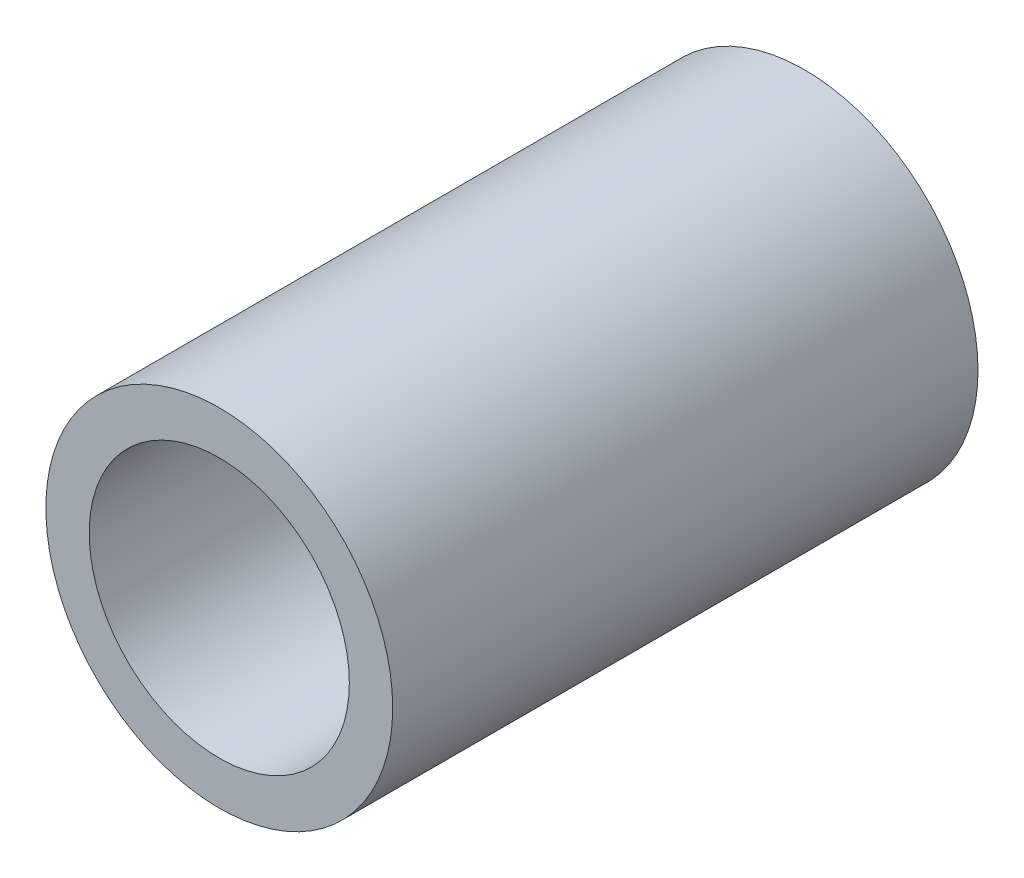
ISO-10303-21;
HEADER;
FILE_DESCRIPTION(('STEP AP214'),'2;1');
FILE_NAME('part.step','',(''),(''),'','','');
FILE_SCHEMA(('AUTOMOTIVE_DESIGN { 1 0 10303 214 1 1 1 1 }'));
ENDSEC;
DATA;
#1=APPLICATION_CONTEXT('core data for automotive mechanical design processes');
#2=APPLICATION_PROTOCOL_DEFINITION('international standard','automotive_design',2000,#1);
#3=PRODUCT_CONTEXT('',#1,'mechanical');
#4=PRODUCT('Part','Part','',(#3));
#5=PRODUCT_RELATED_PRODUCT_CATEGORY('part','',(#4));
#6=PRODUCT_DEFINITION_FORMATION('','',#4);
#7=PRODUCT_DEFINITION_CONTEXT('part definition',#1,'design');
#8=PRODUCT_DEFINITION('design','',#6,#7);
#9=PRODUCT_DEFINITION_SHAPE('','',#8);
#10=(LENGTH_UNIT() NAMED_UNIT(*) SI_UNIT(.MILLI.,.METRE.));
#11=(NAMED_UNIT(*) PLANE_ANGLE_UNIT() SI_UNIT($,.RADIAN.));
#12=(NAMED_UNIT(*) SI_UNIT($,.STERADIAN.) SOLID_ANGLE_UNIT());
#13=UNCERTAINTY_MEASURE_WITH_UNIT(LENGTH_MEASURE(1.E-05),#10,'distance_accuracy_value','');
#14=(GEOMETRIC_REPRESENTATION_CONTEXT(3) GLOBAL_UNCERTAINTY_ASSIGNED_CONTEXT((#13)) GLOBAL_UNIT_ASSIGNED_CONTEXT((#10,
#11,#12)) REPRESENTATION_CONTEXT('',''));
#15=CARTESIAN_POINT('',(0.,0.,0.));
#16=DIRECTION('',(0.,0.,1.));
#17=DIRECTION('',(1.,0.,0.));
#18=AXIS2_PLACEMENT_3D('',#15,#16,#17);
#19=CARTESIAN_POINT('',(0.,0.,14.2875));
#20=DIRECTION('',(0.,0.,1.));
#21=DIRECTION('',(1.,0.,0.));
#22=AXIS2_PLACEMENT_3D('',#19,#20,#21);
#23=PLANE('',#22);
#24=CARTESIAN_POINT('',(0.,0.,14.2875));
#25=DIRECTION('',(0.,0.,1.));
#26=DIRECTION('',(1.,0.,0.));
#27=AXIS2_PLACEMENT_3D('',#24,#25,#26);
#28=CIRCLE('',#27,4.23333333333333);
#29=CARTESIAN_POINT('',(4.23333333333333,0.,14.2875));
#30=VERTEX_POINT('',#29);
#31=EDGE_CURVE('E10',#30,#30,#28,.T.);
#32=ORIENTED_EDGE('',*,*,#31,.T.);
#33=EDGE_LOOP('',(#32));
#34=FACE_BOUND('',#33,.T.);
#35=CARTESIAN_POINT('',(0.,0.,14.2875));
#36=DIRECTION('',(0.,0.,1.));
#37=DIRECTION('',(1.,0.,0.));
#38=AXIS2_PLACEMENT_3D('',#35,#36,#37);
#39=CIRCLE('',#38,3.175);
#40=CARTESIAN_POINT('',(3.175,0.,14.2875));
#41=VERTEX_POINT('',#40);
#42=EDGE_CURVE('E41',#41,#41,#39,.T.);
#43=ORIENTED_EDGE('',*,*,#42,.F.);
#44=EDGE_LOOP('',(#43));
#45=FACE_BOUND('',#44,.T.);
#46=ADVANCED_FACE('F30',(#34,#45),#23,.T.);
#47=CARTESIAN_POINT('',(0.,0.,0.));
#48=DIRECTION('',(0.,0.,1.));
#49=DIRECTION('',(1.,0.,0.));
#50=AXIS2_PLACEMENT_3D('',#47,#48,#49);
#51=PLANE('',#50);
#52=CARTESIAN_POINT('',(0.,0.,0.));
#53=DIRECTION('',(0.,0.,1.));
#54=DIRECTION('',(1.,0.,0.));
#55=AXIS2_PLACEMENT_3D('',#52,#53,#54);
#56=CIRCLE('',#55,4.23333333333333);
#57=CARTESIAN_POINT('',(4.23333333333333,0.,0.));
#58=VERTEX_POINT('',#57);
#59=EDGE_CURVE('E34',#58,#58,#56,.T.);
#60=ORIENTED_EDGE('',*,*,#59,.F.);
#61=EDGE_LOOP('',(#60));
#62=FACE_BOUND('',#61,.T.);
#63=CARTESIAN_POINT('',(0.,0.,0.));
#64=DIRECTION('',(0.,0.,1.));
#65=DIRECTION('',(1.,0.,0.));
#66=AXIS2_PLACEMENT_3D('',#63,#64,#65);
#67=CIRCLE('',#66,3.175);
#68=CARTESIAN_POINT('',(3.175,0.,0.));
#69=VERTEX_POINT('',#68);
#70=EDGE_CURVE('E43',#69,#69,#67,.T.);
#71=ORIENTED_EDGE('',*,*,#70,.T.);
#72=EDGE_LOOP('',(#71));
#73=FACE_BOUND('',#72,.T.);
#74=ADVANCED_FACE('F53',(#62,#73),#51,.F.);
#75=CARTESIAN_POINT('',(0.,0.,14.2875));
#76=DIRECTION('',(0.,0.,-1.));
#77=DIRECTION('',(-1.,0.,0.));
#78=AXIS2_PLACEMENT_3D('',#75,#76,#77);
#79=CYLINDRICAL_SURFACE('',#78,4.23333333333333);
#80=ORIENTED_EDGE('',*,*,#31,.F.);
#81=EDGE_LOOP('',(#80));
#82=FACE_BOUND('',#81,.T.);
#83=ORIENTED_EDGE('',*,*,#59,.T.);
#84=EDGE_LOOP('',(#83));
#85=FACE_BOUND('',#84,.T.);
#86=ADVANCED_FACE('F32',(#82,#85),#79,.T.);
#87=CARTESIAN_POINT('',(0.,0.,14.2875));
#88=DIRECTION('',(0.,0.,-1.));
#89=DIRECTION('',(-1.,0.,0.));
#90=AXIS2_PLACEMENT_3D('',#87,#88,#89);
#91=CYLINDRICAL_SURFACE('',#90,3.175);
#92=ORIENTED_EDGE('',*,*,#42,.T.);
#93=EDGE_LOOP('',(#92));
#94=FACE_BOUND('',#93,.T.);
#95=ORIENTED_EDGE('',*,*,#70,.F.);
#96=EDGE_LOOP('',(#95));
#97=FACE_BOUND('',#96,.T.);
#98=ADVANCED_FACE('F49',(#94,#97),#91,.F.);
#99=CLOSED_SHELL('',(#46,#74,#86,#98));
#100=MANIFOLD_SOLID_BREP('B2',#99);
#101=ADVANCED_BREP_SHAPE_REPRESENTATION('',(#18,#100),#14);
#102=SHAPE_DEFINITION_REPRESENTATION(#9,#101);
ENDSEC;
END-ISO-10303-21;
